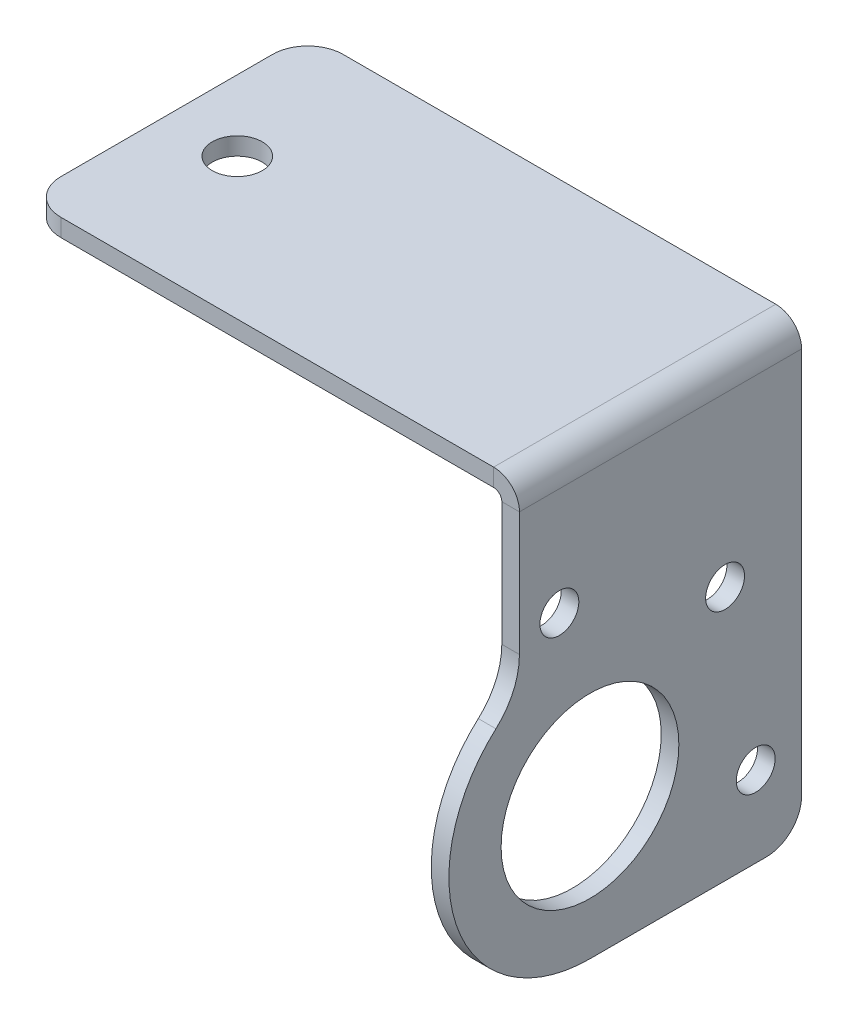
ISO-10303-21;
HEADER;
FILE_DESCRIPTION(('STEP AP214'),'2;1');
FILE_NAME('part.step','',(''),(''),'','','');
FILE_SCHEMA(('AUTOMOTIVE_DESIGN { 1 0 10303 214 1 1 1 1 }'));
ENDSEC;
DATA;
#1=APPLICATION_CONTEXT('core data for automotive mechanical design processes');
#2=APPLICATION_PROTOCOL_DEFINITION('international standard','automotive_design',2000,#1);
#3=PRODUCT_CONTEXT('',#1,'mechanical');
#4=PRODUCT('Part','Part','',(#3));
#5=PRODUCT_RELATED_PRODUCT_CATEGORY('part','',(#4));
#6=PRODUCT_DEFINITION_FORMATION('','',#4);
#7=PRODUCT_DEFINITION_CONTEXT('part definition',#1,'design');
#8=PRODUCT_DEFINITION('design','',#6,#7);
#9=PRODUCT_DEFINITION_SHAPE('','',#8);
#10=(LENGTH_UNIT() NAMED_UNIT(*) SI_UNIT(.MILLI.,.METRE.));
#11=(NAMED_UNIT(*) PLANE_ANGLE_UNIT() SI_UNIT($,.RADIAN.));
#12=(NAMED_UNIT(*) SI_UNIT($,.STERADIAN.) SOLID_ANGLE_UNIT());
#13=UNCERTAINTY_MEASURE_WITH_UNIT(LENGTH_MEASURE(1.E-05),#10,'distance_accuracy_value','');
#14=(GEOMETRIC_REPRESENTATION_CONTEXT(3) GLOBAL_UNCERTAINTY_ASSIGNED_CONTEXT((#13)) GLOBAL_UNIT_ASSIGNED_CONTEXT((#10,
#11,#12)) REPRESENTATION_CONTEXT('',''));
#15=CARTESIAN_POINT('',(0.,0.,0.));
#16=DIRECTION('',(0.,0.,1.));
#17=DIRECTION('',(1.,0.,0.));
#18=AXIS2_PLACEMENT_3D('',#15,#16,#17);
#19=CARTESIAN_POINT('',(38.1,-13.4453001841658,19.05));
#20=DIRECTION('',(-1.,0.,0.));
#21=DIRECTION('',(0.,0.,-1.));
#22=AXIS2_PLACEMENT_3D('',#19,#20,#21);
#23=PLANE('',#22);
#24=CARTESIAN_POINT('',(38.0999999999999,-27.6443318412894,6.35));
#25=DIRECTION('',(1.,0.,0.));
#26=DIRECTION('',(0.,0.,1.));
#27=AXIS2_PLACEMENT_3D('',#24,#25,#26);
#28=CIRCLE('',#27,8.);
#29=CARTESIAN_POINT('',(38.0999999999999,-27.6443318412894,14.35));
#30=VERTEX_POINT('',#29);
#31=EDGE_CURVE('E237',#30,#30,#28,.T.);
#32=ORIENTED_EDGE('',*,*,#31,.F.);
#33=EDGE_LOOP('',(#32));
#34=FACE_BOUND('',#33,.T.);
#35=CARTESIAN_POINT('',(38.1,-12.0105087622206,9.10666482046241));
#36=DIRECTION('',(1.,0.,0.));
#37=DIRECTION('',(0.,0.,1.));
#38=AXIS2_PLACEMENT_3D('',#35,#36,#37);
#39=CIRCLE('',#38,1.75);
#40=CARTESIAN_POINT('',(38.1,-12.0105087622206,10.8566648204624));
#41=VERTEX_POINT('',#40);
#42=EDGE_CURVE('E231',#41,#41,#39,.T.);
#43=ORIENTED_EDGE('',*,*,#42,.F.);
#44=EDGE_LOOP('',(#43));
#45=FACE_BOUND('',#44,.T.);
#46=CARTESIAN_POINT('',(38.0999999999999,-17.4400785375157,-5.81095553451387));
#47=DIRECTION('',(1.,0.,0.));
#48=DIRECTION('',(0.,0.,1.));
#49=AXIS2_PLACEMENT_3D('',#46,#47,#48);
#50=CIRCLE('',#49,1.75000000000001);
#51=CARTESIAN_POINT('',(38.0999999999999,-17.4400785375157,-4.06095553451386));
#52=VERTEX_POINT('',#51);
#53=EDGE_CURVE('E224',#52,#52,#50,.T.);
#54=ORIENTED_EDGE('',*,*,#53,.F.);
#55=EDGE_LOOP('',(#54));
#56=FACE_BOUND('',#55,.T.);
#57=CARTESIAN_POINT('',(38.0999999999999,-33.0739016165846,-8.56762035497623));
#58=DIRECTION('',(1.,0.,0.));
#59=DIRECTION('',(0.,0.,1.));
#60=AXIS2_PLACEMENT_3D('',#57,#58,#59);
#61=CIRCLE('',#60,1.75);
#62=CARTESIAN_POINT('',(38.0999999999999,-33.0739016165846,-6.81762035497623));
#63=VERTEX_POINT('',#62);
#64=EDGE_CURVE('E225',#63,#63,#61,.T.);
#65=ORIENTED_EDGE('',*,*,#64,.F.);
#66=EDGE_LOOP('',(#65));
#67=FACE_BOUND('',#66,.T.);
#68=DIRECTION('',(0.,1.,0.));
#69=VECTOR('',#68,1.);
#70=CARTESIAN_POINT('',(38.1000000000002,39.0306681587105,-12.7));
#71=LINE('',#70,#69);
#72=CARTESIAN_POINT('',(38.0999999999999,-37.1693318412894,-12.7));
#73=VERTEX_POINT('',#72);
#74=CARTESIAN_POINT('',(38.1,-2.32410000000001,-12.7));
#75=VERTEX_POINT('',#74);
#76=EDGE_CURVE('E64',#73,#75,#71,.T.);
#77=ORIENTED_EDGE('',*,*,#76,.T.);
#78=DIRECTION('',(0.,0.,1.));
#79=VECTOR('',#78,1.);
#80=CARTESIAN_POINT('',(38.1,-2.32410000000001,19.05));
#81=LINE('',#80,#79);
#82=CARTESIAN_POINT('',(38.1,-2.32410000000001,12.7));
#83=VERTEX_POINT('',#82);
#84=EDGE_CURVE('E56',#75,#83,#81,.T.);
#85=ORIENTED_EDGE('',*,*,#84,.T.);
#86=DIRECTION('',(0.,-1.,0.));
#87=VECTOR('',#86,1.);
#88=CARTESIAN_POINT('',(38.1000000000002,39.0306681587105,12.7));
#89=LINE('',#88,#87);
#90=CARTESIAN_POINT('',(38.1,-13.4453001841658,12.7));
#91=VERTEX_POINT('',#90);
#92=EDGE_CURVE('E72',#83,#91,#89,.T.);
#93=ORIENTED_EDGE('',*,*,#92,.T.);
#94=CARTESIAN_POINT('',(38.1,-13.4453001841658,19.05));
#95=DIRECTION('',(-1.,0.,0.));
#96=DIRECTION('',(0.,0.,-1.));
#97=AXIS2_PLACEMENT_3D('',#94,#95,#96);
#98=CIRCLE('',#97,6.35);
#99=CARTESIAN_POINT('',(38.0999999999999,-18.1783107365403,14.8166666666667));
#100=VERTEX_POINT('',#99);
#101=EDGE_CURVE('E243',#91,#100,#98,.T.);
#102=ORIENTED_EDGE('',*,*,#101,.T.);
#103=CARTESIAN_POINT('',(38.0999999999999,-27.6443318412894,6.35));
#104=DIRECTION('',(1.,0.,0.));
#105=DIRECTION('',(0.,0.,1.));
#106=AXIS2_PLACEMENT_3D('',#103,#104,#105);
#107=CIRCLE('',#106,12.7);
#108=CARTESIAN_POINT('',(38.0999999999999,-40.3443318412894,6.35));
#109=VERTEX_POINT('',#108);
#110=EDGE_CURVE('E261',#100,#109,#107,.T.);
#111=ORIENTED_EDGE('',*,*,#110,.T.);
#112=DIRECTION('',(0.,0.,-1.));
#113=VECTOR('',#112,1.);
#114=CARTESIAN_POINT('',(38.0999999999999,-40.3443318412894,6.35));
#115=LINE('',#114,#113);
#116=CARTESIAN_POINT('',(38.0999999999999,-40.3443318412894,-9.52499999999998));
#117=VERTEX_POINT('',#116);
#118=EDGE_CURVE('E264',#109,#117,#115,.T.);
#119=ORIENTED_EDGE('',*,*,#118,.T.);
#120=CARTESIAN_POINT('',(38.0999999999999,-37.1693318412894,-9.525));
#121=DIRECTION('',(1.,0.,0.));
#122=DIRECTION('',(0.,0.,-1.));
#123=AXIS2_PLACEMENT_3D('',#120,#121,#122);
#124=CIRCLE('',#123,3.175);
#125=EDGE_CURVE('E267',#117,#73,#124,.T.);
#126=ORIENTED_EDGE('',*,*,#125,.T.);
#127=EDGE_LOOP('',(#77,#85,#93,#102,#111,#119,#126));
#128=FACE_BOUND('',#127,.T.);
#129=ADVANCED_FACE('F47',(#34,#45,#56,#67,#128),#23,.F.);
#130=CARTESIAN_POINT('',(36.5125000000001,39.0306681587106,12.7));
#131=DIRECTION('',(0.,0.,1.));
#132=DIRECTION('',(0.,-1.,0.));
#133=AXIS2_PLACEMENT_3D('',#130,#131,#132);
#134=PLANE('',#133);
#135=DIRECTION('',(1.,0.,0.));
#136=VECTOR('',#135,1.);
#137=CARTESIAN_POINT('',(36.5125,-2.3241,12.7));
#138=LINE('',#137,#136);
#139=CARTESIAN_POINT('',(36.5125,-2.3241,12.7));
#140=VERTEX_POINT('',#139);
#141=EDGE_CURVE('E282',#140,#83,#138,.T.);
#142=ORIENTED_EDGE('',*,*,#141,.F.);
#143=DIRECTION('',(0.,-1.,0.));
#144=VECTOR('',#143,1.);
#145=CARTESIAN_POINT('',(36.5125,-2.24433184128942,12.7));
#146=LINE('',#145,#144);
#147=CARTESIAN_POINT('',(36.5125,-13.4453001841658,12.7));
#148=VERTEX_POINT('',#147);
#149=EDGE_CURVE('E51',#140,#148,#146,.T.);
#150=ORIENTED_EDGE('',*,*,#149,.T.);
#151=DIRECTION('',(1.,0.,0.));
#152=VECTOR('',#151,1.);
#153=CARTESIAN_POINT('',(36.5125,-13.4453001841658,12.7));
#154=LINE('',#153,#152);
#155=EDGE_CURVE('E279',#148,#91,#154,.T.);
#156=ORIENTED_EDGE('',*,*,#155,.T.);
#157=ORIENTED_EDGE('',*,*,#92,.F.);
#158=EDGE_LOOP('',(#142,#150,#156,#157));
#159=FACE_BOUND('',#158,.T.);
#160=ADVANCED_FACE('F290',(#159),#134,.T.);
#161=CARTESIAN_POINT('',(36.5125000000001,39.0306681587106,-12.7));
#162=DIRECTION('',(0.,0.,-1.));
#163=DIRECTION('',(0.,1.,0.));
#164=AXIS2_PLACEMENT_3D('',#161,#162,#163);
#165=PLANE('',#164);
#166=DIRECTION('',(-1.,0.,0.));
#167=VECTOR('',#166,1.);
#168=CARTESIAN_POINT('',(36.5125,-2.3241,-12.7));
#169=LINE('',#168,#167);
#170=CARTESIAN_POINT('',(36.5125,-2.3241,-12.7));
#171=VERTEX_POINT('',#170);
#172=EDGE_CURVE('E12',#75,#171,#169,.T.);
#173=ORIENTED_EDGE('',*,*,#172,.F.);
#174=ORIENTED_EDGE('',*,*,#76,.F.);
#175=DIRECTION('',(1.,0.,0.));
#176=VECTOR('',#175,1.);
#177=CARTESIAN_POINT('',(36.5124999999999,-37.1693318412894,-12.7));
#178=LINE('',#177,#176);
#179=CARTESIAN_POINT('',(36.5124999999999,-37.1693318412894,-12.7));
#180=VERTEX_POINT('',#179);
#181=EDGE_CURVE('E269',#180,#73,#178,.T.);
#182=ORIENTED_EDGE('',*,*,#181,.F.);
#183=DIRECTION('',(0.,1.,0.));
#184=VECTOR('',#183,1.);
#185=CARTESIAN_POINT('',(36.5125,-2.24433184128942,-12.7));
#186=LINE('',#185,#184);
#187=EDGE_CURVE('E258',#180,#171,#186,.T.);
#188=ORIENTED_EDGE('',*,*,#187,.T.);
#189=EDGE_LOOP('',(#173,#174,#182,#188));
#190=FACE_BOUND('',#189,.T.);
#191=ADVANCED_FACE('F49',(#190),#165,.T.);
#192=CARTESIAN_POINT('',(36.5124999999999,-37.1693318412894,-9.525));
#193=DIRECTION('',(1.,0.,0.));
#194=DIRECTION('',(0.,0.,1.));
#195=AXIS2_PLACEMENT_3D('',#192,#193,#194);
#196=CYLINDRICAL_SURFACE('',#195,3.175);
#197=ORIENTED_EDGE('',*,*,#125,.F.);
#198=DIRECTION('',(1.,0.,0.));
#199=VECTOR('',#198,1.);
#200=CARTESIAN_POINT('',(36.5124999999999,-40.3443318412894,-9.52499999999998));
#201=LINE('',#200,#199);
#202=CARTESIAN_POINT('',(36.5124999999999,-40.3443318412894,-9.52499999999998));
#203=VERTEX_POINT('',#202);
#204=EDGE_CURVE('E273',#203,#117,#201,.T.);
#205=ORIENTED_EDGE('',*,*,#204,.F.);
#206=CARTESIAN_POINT('',(36.5124999999999,-37.1693318412894,-9.525));
#207=DIRECTION('',(1.,0.,0.));
#208=DIRECTION('',(0.,0.,-1.));
#209=AXIS2_PLACEMENT_3D('',#206,#207,#208);
#210=CIRCLE('',#209,3.175);
#211=EDGE_CURVE('E255',#203,#180,#210,.T.);
#212=ORIENTED_EDGE('',*,*,#211,.T.);
#213=ORIENTED_EDGE('',*,*,#181,.T.);
#214=EDGE_LOOP('',(#197,#205,#212,#213));
#215=FACE_BOUND('',#214,.T.);
#216=ADVANCED_FACE('F324',(#215),#196,.T.);
#217=CARTESIAN_POINT('',(36.5124999999999,-40.3443318412894,6.35));
#218=DIRECTION('',(0.,-1.,0.));
#219=DIRECTION('',(0.,0.,-1.));
#220=AXIS2_PLACEMENT_3D('',#217,#218,#219);
#221=PLANE('',#220);
#222=ORIENTED_EDGE('',*,*,#118,.F.);
#223=DIRECTION('',(1.,0.,0.));
#224=VECTOR('',#223,1.);
#225=CARTESIAN_POINT('',(36.5124999999999,-40.3443318412894,6.35));
#226=LINE('',#225,#224);
#227=CARTESIAN_POINT('',(36.5124999999999,-40.3443318412894,6.35));
#228=VERTEX_POINT('',#227);
#229=EDGE_CURVE('E275',#228,#109,#226,.T.);
#230=ORIENTED_EDGE('',*,*,#229,.F.);
#231=DIRECTION('',(0.,0.,-1.));
#232=VECTOR('',#231,1.);
#233=CARTESIAN_POINT('',(36.5124999999999,-40.3443318412894,6.35));
#234=LINE('',#233,#232);
#235=EDGE_CURVE('E252',#228,#203,#234,.T.);
#236=ORIENTED_EDGE('',*,*,#235,.T.);
#237=ORIENTED_EDGE('',*,*,#204,.T.);
#238=EDGE_LOOP('',(#222,#230,#236,#237));
#239=FACE_BOUND('',#238,.T.);
#240=ADVANCED_FACE('F321',(#239),#221,.T.);
#241=CARTESIAN_POINT('',(36.5124999999999,-27.6443318412894,6.35));
#242=DIRECTION('',(1.,0.,0.));
#243=DIRECTION('',(0.,0.,1.));
#244=AXIS2_PLACEMENT_3D('',#241,#242,#243);
#245=CYLINDRICAL_SURFACE('',#244,12.7);
#246=ORIENTED_EDGE('',*,*,#110,.F.);
#247=DIRECTION('',(1.,0.,0.));
#248=VECTOR('',#247,1.);
#249=CARTESIAN_POINT('',(36.5124999999999,-18.1783107365403,14.8166666666667));
#250=LINE('',#249,#248);
#251=CARTESIAN_POINT('',(36.5124999999999,-18.1783107365403,14.8166666666667));
#252=VERTEX_POINT('',#251);
#253=EDGE_CURVE('E277',#252,#100,#250,.T.);
#254=ORIENTED_EDGE('',*,*,#253,.F.);
#255=CARTESIAN_POINT('',(36.5124999999999,-27.6443318412894,6.35));
#256=DIRECTION('',(1.,0.,0.));
#257=DIRECTION('',(0.,0.,1.));
#258=AXIS2_PLACEMENT_3D('',#255,#256,#257);
#259=CIRCLE('',#258,12.7);
#260=EDGE_CURVE('E249',#252,#228,#259,.T.);
#261=ORIENTED_EDGE('',*,*,#260,.T.);
#262=ORIENTED_EDGE('',*,*,#229,.T.);
#263=EDGE_LOOP('',(#246,#254,#261,#262));
#264=FACE_BOUND('',#263,.T.);
#265=ADVANCED_FACE('F303',(#264),#245,.T.);
#266=CARTESIAN_POINT('',(36.5125,-13.4453001841658,19.05));
#267=DIRECTION('',(1.,0.,0.));
#268=DIRECTION('',(0.,0.,1.));
#269=AXIS2_PLACEMENT_3D('',#266,#267,#268);
#270=CYLINDRICAL_SURFACE('',#269,6.35);
#271=ORIENTED_EDGE('',*,*,#101,.F.);
#272=ORIENTED_EDGE('',*,*,#155,.F.);
#273=CARTESIAN_POINT('',(36.5125,-13.4453001841658,19.05));
#274=DIRECTION('',(-1.,0.,0.));
#275=DIRECTION('',(0.,0.,-1.));
#276=AXIS2_PLACEMENT_3D('',#273,#274,#275);
#277=CIRCLE('',#276,6.35);
#278=EDGE_CURVE('E246',#148,#252,#277,.T.);
#279=ORIENTED_EDGE('',*,*,#278,.T.);
#280=ORIENTED_EDGE('',*,*,#253,.T.);
#281=EDGE_LOOP('',(#271,#272,#279,#280));
#282=FACE_BOUND('',#281,.T.);
#283=ADVANCED_FACE('F295',(#282),#270,.F.);
#284=CARTESIAN_POINT('',(36.5125,-13.4453001841658,19.05));
#285=DIRECTION('',(-1.,0.,0.));
#286=DIRECTION('',(0.,0.,-1.));
#287=AXIS2_PLACEMENT_3D('',#284,#285,#286);
#288=PLANE('',#287);
#289=DIRECTION('',(0.,0.,1.));
#290=VECTOR('',#289,1.);
#291=CARTESIAN_POINT('',(36.5125,-2.3241,19.05));
#292=LINE('',#291,#290);
#293=EDGE_CURVE('E272',#171,#140,#292,.T.);
#294=ORIENTED_EDGE('',*,*,#293,.F.);
#295=ORIENTED_EDGE('',*,*,#187,.F.);
#296=ORIENTED_EDGE('',*,*,#211,.F.);
#297=ORIENTED_EDGE('',*,*,#235,.F.);
#298=ORIENTED_EDGE('',*,*,#260,.F.);
#299=ORIENTED_EDGE('',*,*,#278,.F.);
#300=ORIENTED_EDGE('',*,*,#149,.F.);
#301=EDGE_LOOP('',(#294,#295,#296,#297,#298,#299,#300));
#302=FACE_BOUND('',#301,.T.);
#303=CARTESIAN_POINT('',(36.5124999999999,-33.0739016165846,-8.56762035497623));
#304=DIRECTION('',(1.,0.,0.));
#305=DIRECTION('',(0.,0.,1.));
#306=AXIS2_PLACEMENT_3D('',#303,#304,#305);
#307=CIRCLE('',#306,1.75);
#308=CARTESIAN_POINT('',(36.5124999999999,-33.0739016165846,-6.81762035497623));
#309=VERTEX_POINT('',#308);
#310=EDGE_CURVE('E221',#309,#309,#307,.T.);
#311=ORIENTED_EDGE('',*,*,#310,.T.);
#312=EDGE_LOOP('',(#311));
#313=FACE_BOUND('',#312,.T.);
#314=CARTESIAN_POINT('',(36.5124999999999,-17.4400785375157,-5.81095553451387));
#315=DIRECTION('',(1.,0.,0.));
#316=DIRECTION('',(0.,0.,1.));
#317=AXIS2_PLACEMENT_3D('',#314,#315,#316);
#318=CIRCLE('',#317,1.75000000000001);
#319=CARTESIAN_POINT('',(36.5124999999999,-17.4400785375157,-4.06095553451386));
#320=VERTEX_POINT('',#319);
#321=EDGE_CURVE('E228',#320,#320,#318,.T.);
#322=ORIENTED_EDGE('',*,*,#321,.T.);
#323=EDGE_LOOP('',(#322));
#324=FACE_BOUND('',#323,.T.);
#325=CARTESIAN_POINT('',(36.5125,-12.0105087622206,9.10666482046241));
#326=DIRECTION('',(1.,0.,0.));
#327=DIRECTION('',(0.,0.,1.));
#328=AXIS2_PLACEMENT_3D('',#325,#326,#327);
#329=CIRCLE('',#328,1.75);
#330=CARTESIAN_POINT('',(36.5125,-12.0105087622206,10.8566648204624));
#331=VERTEX_POINT('',#330);
#332=EDGE_CURVE('E234',#331,#331,#329,.T.);
#333=ORIENTED_EDGE('',*,*,#332,.T.);
#334=EDGE_LOOP('',(#333));
#335=FACE_BOUND('',#334,.T.);
#336=CARTESIAN_POINT('',(36.5124999999999,-27.6443318412894,6.35));
#337=DIRECTION('',(1.,0.,0.));
#338=DIRECTION('',(0.,0.,1.));
#339=AXIS2_PLACEMENT_3D('',#336,#337,#338);
#340=CIRCLE('',#339,8.);
#341=CARTESIAN_POINT('',(36.5124999999999,-27.6443318412894,14.35));
#342=VERTEX_POINT('',#341);
#343=EDGE_CURVE('E240',#342,#342,#340,.T.);
#344=ORIENTED_EDGE('',*,*,#343,.T.);
#345=EDGE_LOOP('',(#344));
#346=FACE_BOUND('',#345,.T.);
#347=ADVANCED_FACE('F297',(#302,#313,#324,#335,#346),#288,.T.);
#348=CARTESIAN_POINT('',(36.5124999999999,-27.6443318412894,6.35));
#349=DIRECTION('',(1.,0.,0.));
#350=DIRECTION('',(0.,0.,1.));
#351=AXIS2_PLACEMENT_3D('',#348,#349,#350);
#352=CYLINDRICAL_SURFACE('',#351,8.);
#353=ORIENTED_EDGE('',*,*,#343,.F.);
#354=EDGE_LOOP('',(#353));
#355=FACE_BOUND('',#354,.T.);
#356=ORIENTED_EDGE('',*,*,#31,.T.);
#357=EDGE_LOOP('',(#356));
#358=FACE_BOUND('',#357,.T.);
#359=ADVANCED_FACE('F316',(#355,#358),#352,.F.);
#360=CARTESIAN_POINT('',(36.5125,-12.0105087622206,9.10666482046241));
#361=DIRECTION('',(1.,0.,0.));
#362=DIRECTION('',(0.,0.,1.));
#363=AXIS2_PLACEMENT_3D('',#360,#361,#362);
#364=CYLINDRICAL_SURFACE('',#363,1.75);
#365=ORIENTED_EDGE('',*,*,#332,.F.);
#366=EDGE_LOOP('',(#365));
#367=FACE_BOUND('',#366,.T.);
#368=ORIENTED_EDGE('',*,*,#42,.T.);
#369=EDGE_LOOP('',(#368));
#370=FACE_BOUND('',#369,.T.);
#371=ADVANCED_FACE('F331',(#367,#370),#364,.F.);
#372=CARTESIAN_POINT('',(36.5124999999999,-17.4400785375157,-5.81095553451387));
#373=DIRECTION('',(1.,0.,0.));
#374=DIRECTION('',(0.,0.,1.));
#375=AXIS2_PLACEMENT_3D('',#372,#373,#374);
#376=CYLINDRICAL_SURFACE('',#375,1.75000000000001);
#377=ORIENTED_EDGE('',*,*,#321,.F.);
#378=EDGE_LOOP('',(#377));
#379=FACE_BOUND('',#378,.T.);
#380=ORIENTED_EDGE('',*,*,#53,.T.);
#381=EDGE_LOOP('',(#380));
#382=FACE_BOUND('',#381,.T.);
#383=ADVANCED_FACE('F335',(#379,#382),#376,.F.);
#384=CARTESIAN_POINT('',(36.5124999999999,-33.0739016165846,-8.56762035497623));
#385=DIRECTION('',(1.,0.,0.));
#386=DIRECTION('',(0.,0.,1.));
#387=AXIS2_PLACEMENT_3D('',#384,#385,#386);
#388=CYLINDRICAL_SURFACE('',#387,1.75);
#389=ORIENTED_EDGE('',*,*,#310,.F.);
#390=EDGE_LOOP('',(#389));
#391=FACE_BOUND('',#390,.T.);
#392=ORIENTED_EDGE('',*,*,#64,.T.);
#393=EDGE_LOOP('',(#392));
#394=FACE_BOUND('',#393,.T.);
#395=ADVANCED_FACE('F339',(#391,#394),#388,.F.);
#396=CARTESIAN_POINT('',(-3.175,-1.5875,-9.525));
#397=DIRECTION('',(0.,1.,0.));
#398=DIRECTION('',(0.,0.,1.));
#399=AXIS2_PLACEMENT_3D('',#396,#397,#398);
#400=CYLINDRICAL_SURFACE('',#399,3.175);
#401=CARTESIAN_POINT('',(-3.175,0.,-9.525));
#402=DIRECTION('',(0.,1.,0.));
#403=DIRECTION('',(0.,0.,1.));
#404=AXIS2_PLACEMENT_3D('',#401,#402,#403);
#405=CIRCLE('',#404,3.175);
#406=CARTESIAN_POINT('',(-3.17499999999998,0.,-12.7));
#407=VERTEX_POINT('',#406);
#408=CARTESIAN_POINT('',(-6.35,0.,-9.52499999999998));
#409=VERTEX_POINT('',#408);
#410=EDGE_CURVE('E193',#407,#409,#405,.T.);
#411=ORIENTED_EDGE('',*,*,#410,.F.);
#412=DIRECTION('',(0.,1.,0.));
#413=VECTOR('',#412,1.);
#414=CARTESIAN_POINT('',(-3.17499999999998,-1.5875,-12.7));
#415=LINE('',#414,#413);
#416=CARTESIAN_POINT('',(-3.17499999999998,-1.5875,-12.7));
#417=VERTEX_POINT('',#416);
#418=EDGE_CURVE('E175',#417,#407,#415,.T.);
#419=ORIENTED_EDGE('',*,*,#418,.F.);
#420=CARTESIAN_POINT('',(-3.175,-1.5875,-9.525));
#421=DIRECTION('',(0.,1.,0.));
#422=DIRECTION('',(0.,0.,1.));
#423=AXIS2_PLACEMENT_3D('',#420,#421,#422);
#424=CIRCLE('',#423,3.175);
#425=CARTESIAN_POINT('',(-6.35,-1.5875,-9.52499999999998));
#426=VERTEX_POINT('',#425);
#427=EDGE_CURVE('E171',#417,#426,#424,.T.);
#428=ORIENTED_EDGE('',*,*,#427,.T.);
#429=DIRECTION('',(0.,1.,0.));
#430=VECTOR('',#429,1.);
#431=CARTESIAN_POINT('',(-6.35,-1.5875,-9.52499999999998));
#432=LINE('',#431,#430);
#433=EDGE_CURVE('E216',#426,#409,#432,.T.);
#434=ORIENTED_EDGE('',*,*,#433,.T.);
#435=EDGE_LOOP('',(#411,#419,#428,#434));
#436=FACE_BOUND('',#435,.T.);
#437=ADVANCED_FACE('F343',(#436),#400,.T.);
#438=CARTESIAN_POINT('',(-6.35,-1.5875,-9.52499999999998));
#439=DIRECTION('',(-1.,0.,0.));
#440=DIRECTION('',(0.,0.,1.));
#441=AXIS2_PLACEMENT_3D('',#438,#439,#440);
#442=PLANE('',#441);
#443=DIRECTION('',(0.,0.,1.));
#444=VECTOR('',#443,1.);
#445=CARTESIAN_POINT('',(-6.35,0.,-9.52499999999998));
#446=LINE('',#445,#444);
#447=CARTESIAN_POINT('',(-6.35,0.,9.52499999999998));
#448=VERTEX_POINT('',#447);
#449=EDGE_CURVE('E190',#409,#448,#446,.T.);
#450=ORIENTED_EDGE('',*,*,#449,.F.);
#451=ORIENTED_EDGE('',*,*,#433,.F.);
#452=DIRECTION('',(0.,0.,1.));
#453=VECTOR('',#452,1.);
#454=CARTESIAN_POINT('',(-6.35,-1.5875,-9.52499999999998));
#455=LINE('',#454,#453);
#456=CARTESIAN_POINT('',(-6.35,-1.5875,9.52499999999998));
#457=VERTEX_POINT('',#456);
#458=EDGE_CURVE('E213',#426,#457,#455,.T.);
#459=ORIENTED_EDGE('',*,*,#458,.T.);
#460=DIRECTION('',(0.,1.,0.));
#461=VECTOR('',#460,1.);
#462=CARTESIAN_POINT('',(-6.35,-1.5875,9.52499999999998));
#463=LINE('',#462,#461);
#464=EDGE_CURVE('E211',#457,#448,#463,.T.);
#465=ORIENTED_EDGE('',*,*,#464,.T.);
#466=EDGE_LOOP('',(#450,#451,#459,#465));
#467=FACE_BOUND('',#466,.T.);
#468=ADVANCED_FACE('F365',(#467),#442,.T.);
#469=CARTESIAN_POINT('',(-3.175,-1.5875,9.525));
#470=DIRECTION('',(0.,1.,0.));
#471=DIRECTION('',(0.,0.,1.));
#472=AXIS2_PLACEMENT_3D('',#469,#470,#471);
#473=CYLINDRICAL_SURFACE('',#472,3.175);
#474=CARTESIAN_POINT('',(-3.175,0.,9.525));
#475=DIRECTION('',(0.,1.,0.));
#476=DIRECTION('',(0.,0.,1.));
#477=AXIS2_PLACEMENT_3D('',#474,#475,#476);
#478=CIRCLE('',#477,3.175);
#479=CARTESIAN_POINT('',(-3.17499999999998,0.,12.7));
#480=VERTEX_POINT('',#479);
#481=EDGE_CURVE('E184',#448,#480,#478,.T.);
#482=ORIENTED_EDGE('',*,*,#481,.F.);
#483=ORIENTED_EDGE('',*,*,#464,.F.);
#484=CARTESIAN_POINT('',(-3.175,-1.5875,9.525));
#485=DIRECTION('',(0.,1.,0.));
#486=DIRECTION('',(0.,0.,1.));
#487=AXIS2_PLACEMENT_3D('',#484,#485,#486);
#488=CIRCLE('',#487,3.175);
#489=CARTESIAN_POINT('',(-3.17499999999998,-1.5875,12.7));
#490=VERTEX_POINT('',#489);
#491=EDGE_CURVE('E208',#457,#490,#488,.T.);
#492=ORIENTED_EDGE('',*,*,#491,.T.);
#493=DIRECTION('',(0.,1.,0.));
#494=VECTOR('',#493,1.);
#495=CARTESIAN_POINT('',(-3.17499999999998,-1.5875,12.7));
#496=LINE('',#495,#494);
#497=EDGE_CURVE('E206',#490,#480,#496,.T.);
#498=ORIENTED_EDGE('',*,*,#497,.T.);
#499=EDGE_LOOP('',(#482,#483,#492,#498));
#500=FACE_BOUND('',#499,.T.);
#501=ADVANCED_FACE('F361',(#500),#473,.T.);
#502=CARTESIAN_POINT('',(0.,-1.5875,0.));
#503=DIRECTION('',(0.,1.,0.));
#504=DIRECTION('',(0.,0.,1.));
#505=AXIS2_PLACEMENT_3D('',#502,#503,#504);
#506=CYLINDRICAL_SURFACE('',#505,2.25);
#507=CARTESIAN_POINT('',(0.,-1.5875,0.));
#508=DIRECTION('',(0.,1.,0.));
#509=DIRECTION('',(0.,0.,1.));
#510=AXIS2_PLACEMENT_3D('',#507,#508,#509);
#511=CIRCLE('',#510,2.25);
#512=CARTESIAN_POINT('',(0.,-1.5875,2.25));
#513=VERTEX_POINT('',#512);
#514=EDGE_CURVE('E164',#513,#513,#511,.T.);
#515=ORIENTED_EDGE('',*,*,#514,.F.);
#516=EDGE_LOOP('',(#515));
#517=FACE_BOUND('',#516,.T.);
#518=CARTESIAN_POINT('',(0.,0.,0.));
#519=DIRECTION('',(0.,1.,0.));
#520=DIRECTION('',(0.,0.,1.));
#521=AXIS2_PLACEMENT_3D('',#518,#519,#520);
#522=CIRCLE('',#521,2.25);
#523=CARTESIAN_POINT('',(0.,0.,2.25));
#524=VERTEX_POINT('',#523);
#525=EDGE_CURVE('E203',#524,#524,#522,.T.);
#526=ORIENTED_EDGE('',*,*,#525,.T.);
#527=EDGE_LOOP('',(#526));
#528=FACE_BOUND('',#527,.T.);
#529=ADVANCED_FACE('F357',(#517,#528),#506,.F.);
#530=CARTESIAN_POINT('',(49.3009683428763,-1.5875,19.05));
#531=DIRECTION('',(0.,-1.,0.));
#532=DIRECTION('',(0.,0.,-1.));
#533=AXIS2_PLACEMENT_3D('',#530,#531,#532);
#534=PLANE('',#533);
#535=ORIENTED_EDGE('',*,*,#514,.T.);
#536=EDGE_LOOP('',(#535));
#537=FACE_BOUND('',#536,.T.);
#538=DIRECTION('',(-1.,0.,0.));
#539=VECTOR('',#538,1.);
#540=CARTESIAN_POINT('',(38.1,-1.5875,-12.7));
#541=LINE('',#540,#539);
#542=CARTESIAN_POINT('',(35.7759,-1.5875,-12.7));
#543=VERTEX_POINT('',#542);
#544=EDGE_CURVE('E167',#543,#417,#541,.T.);
#545=ORIENTED_EDGE('',*,*,#544,.F.);
#546=DIRECTION('',(0.,0.,1.));
#547=VECTOR('',#546,1.);
#548=CARTESIAN_POINT('',(35.7759,-1.5875,19.05));
#549=LINE('',#548,#547);
#550=CARTESIAN_POINT('',(35.7759,-1.5875,12.7));
#551=VERTEX_POINT('',#550);
#552=EDGE_CURVE('E157',#543,#551,#549,.T.);
#553=ORIENTED_EDGE('',*,*,#552,.T.);
#554=DIRECTION('',(1.,0.,0.));
#555=VECTOR('',#554,1.);
#556=CARTESIAN_POINT('',(38.1,-1.5875,12.7));
#557=LINE('',#556,#555);
#558=EDGE_CURVE('E163',#490,#551,#557,.T.);
#559=ORIENTED_EDGE('',*,*,#558,.F.);
#560=ORIENTED_EDGE('',*,*,#491,.F.);
#561=ORIENTED_EDGE('',*,*,#458,.F.);
#562=ORIENTED_EDGE('',*,*,#427,.F.);
#563=EDGE_LOOP('',(#545,#553,#559,#560,#561,#562));
#564=FACE_BOUND('',#563,.T.);
#565=ADVANCED_FACE('F168',(#537,#564),#534,.T.);
#566=CARTESIAN_POINT('',(-3.17499999999998,-1.5875,12.7));
#567=DIRECTION('',(0.,0.,1.));
#568=DIRECTION('',(1.,0.,0.));
#569=AXIS2_PLACEMENT_3D('',#566,#567,#568);
#570=PLANE('',#569);
#571=ORIENTED_EDGE('',*,*,#558,.T.);
#572=DIRECTION('',(0.,1.,0.));
#573=VECTOR('',#572,1.);
#574=CARTESIAN_POINT('',(35.7759,-1.5875,12.7));
#575=LINE('',#574,#573);
#576=CARTESIAN_POINT('',(35.7759,0.,12.7));
#577=VERTEX_POINT('',#576);
#578=EDGE_CURVE('E197',#551,#577,#575,.T.);
#579=ORIENTED_EDGE('',*,*,#578,.T.);
#580=DIRECTION('',(1.,0.,0.));
#581=VECTOR('',#580,1.);
#582=CARTESIAN_POINT('',(-3.17499999999998,0.,12.7));
#583=LINE('',#582,#581);
#584=EDGE_CURVE('E181',#480,#577,#583,.T.);
#585=ORIENTED_EDGE('',*,*,#584,.F.);
#586=ORIENTED_EDGE('',*,*,#497,.F.);
#587=EDGE_LOOP('',(#571,#579,#585,#586));
#588=FACE_BOUND('',#587,.T.);
#589=ADVANCED_FACE('F350',(#588),#570,.T.);
#590=CARTESIAN_POINT('',(49.3009683428763,0.,19.05));
#591=DIRECTION('',(0.,-1.,0.));
#592=DIRECTION('',(0.,0.,-1.));
#593=AXIS2_PLACEMENT_3D('',#590,#591,#592);
#594=PLANE('',#593);
#595=DIRECTION('',(0.,0.,1.));
#596=VECTOR('',#595,1.);
#597=CARTESIAN_POINT('',(35.7759,0.,19.05));
#598=LINE('',#597,#596);
#599=CARTESIAN_POINT('',(35.7759,0.,-12.7));
#600=VERTEX_POINT('',#599);
#601=EDGE_CURVE('E219',#600,#577,#598,.T.);
#602=ORIENTED_EDGE('',*,*,#601,.F.);
#603=DIRECTION('',(-1.,0.,0.));
#604=VECTOR('',#603,1.);
#605=CARTESIAN_POINT('',(-3.17499999999998,0.,-12.7));
#606=LINE('',#605,#604);
#607=EDGE_CURVE('E179',#600,#407,#606,.T.);
#608=ORIENTED_EDGE('',*,*,#607,.T.);
#609=ORIENTED_EDGE('',*,*,#410,.T.);
#610=ORIENTED_EDGE('',*,*,#449,.T.);
#611=ORIENTED_EDGE('',*,*,#481,.T.);
#612=ORIENTED_EDGE('',*,*,#584,.T.);
#613=EDGE_LOOP('',(#602,#608,#609,#610,#611,#612));
#614=FACE_BOUND('',#613,.T.);
#615=ORIENTED_EDGE('',*,*,#525,.F.);
#616=EDGE_LOOP('',(#615));
#617=FACE_BOUND('',#616,.T.);
#618=ADVANCED_FACE('F347',(#614,#617),#594,.F.);
#619=CARTESIAN_POINT('',(-3.17499999999998,-1.5875,-12.7));
#620=DIRECTION('',(0.,0.,-1.));
#621=DIRECTION('',(-1.,0.,0.));
#622=AXIS2_PLACEMENT_3D('',#619,#620,#621);
#623=PLANE('',#622);
#624=ORIENTED_EDGE('',*,*,#607,.F.);
#625=DIRECTION('',(0.,-1.,0.));
#626=VECTOR('',#625,1.);
#627=CARTESIAN_POINT('',(35.7759,-1.5875,-12.7));
#628=LINE('',#627,#626);
#629=EDGE_CURVE('E148',#600,#543,#628,.T.);
#630=ORIENTED_EDGE('',*,*,#629,.T.);
#631=ORIENTED_EDGE('',*,*,#544,.T.);
#632=ORIENTED_EDGE('',*,*,#418,.T.);
#633=EDGE_LOOP('',(#624,#630,#631,#632));
#634=FACE_BOUND('',#633,.T.);
#635=ADVANCED_FACE('F178',(#634),#623,.T.);
#636=CARTESIAN_POINT('',(35.7759,-2.3241,-12.7));
#637=DIRECTION('',(0.,0.,1.));
#638=DIRECTION('',(1.,0.,0.));
#639=AXIS2_PLACEMENT_3D('',#636,#637,#638);
#640=PLANE('',#639);
#641=ORIENTED_EDGE('',*,*,#629,.F.);
#642=CARTESIAN_POINT('',(35.7759,-2.3241,-12.7));
#643=DIRECTION('',(0.,0.,1.));
#644=DIRECTION('',(1.,0.,0.));
#645=AXIS2_PLACEMENT_3D('',#642,#643,#644);
#646=CIRCLE('',#645,2.3241);
#647=EDGE_CURVE('E587',#600,#75,#646,.F.);
#648=ORIENTED_EDGE('',*,*,#647,.T.);
#649=ORIENTED_EDGE('',*,*,#172,.T.);
#650=CARTESIAN_POINT('',(35.7759,-2.3241,-12.7));
#651=DIRECTION('',(0.,0.,-1.));
#652=DIRECTION('',(1.,0.,0.));
#653=AXIS2_PLACEMENT_3D('',#650,#651,#652);
#654=CIRCLE('',#653,0.736599999999998);
#655=EDGE_CURVE('E143',#543,#171,#654,.T.);
#656=ORIENTED_EDGE('',*,*,#655,.F.);
#657=EDGE_LOOP('',(#641,#648,#649,#656));
#658=FACE_BOUND('',#657,.T.);
#659=ADVANCED_FACE('F145',(#658),#640,.F.);
#660=CARTESIAN_POINT('',(35.7759,-2.3241,12.7));
#661=DIRECTION('',(0.,0.,-1.));
#662=DIRECTION('',(-1.,0.,0.));
#663=AXIS2_PLACEMENT_3D('',#660,#661,#662);
#664=PLANE('',#663);
#665=ORIENTED_EDGE('',*,*,#141,.T.);
#666=CARTESIAN_POINT('',(35.7759,-2.3241,12.7));
#667=DIRECTION('',(0.,0.,1.));
#668=DIRECTION('',(1.,0.,0.));
#669=AXIS2_PLACEMENT_3D('',#666,#667,#668);
#670=CIRCLE('',#669,2.3241);
#671=EDGE_CURVE('E153',#83,#577,#670,.T.);
#672=ORIENTED_EDGE('',*,*,#671,.T.);
#673=ORIENTED_EDGE('',*,*,#578,.F.);
#674=CARTESIAN_POINT('',(35.7759,-2.3241,12.7));
#675=DIRECTION('',(0.,0.,1.));
#676=DIRECTION('',(-1.,0.,0.));
#677=AXIS2_PLACEMENT_3D('',#674,#675,#676);
#678=CIRCLE('',#677,0.736599999999998);
#679=EDGE_CURVE('E152',#140,#551,#678,.T.);
#680=ORIENTED_EDGE('',*,*,#679,.F.);
#681=EDGE_LOOP('',(#665,#672,#673,#680));
#682=FACE_BOUND('',#681,.T.);
#683=ADVANCED_FACE('F375',(#682),#664,.F.);
#684=CARTESIAN_POINT('',(35.7759,-2.3241,-25.5628390124114));
#685=DIRECTION('',(0.,0.,1.));
#686=DIRECTION('',(1.,0.,0.));
#687=AXIS2_PLACEMENT_3D('',#684,#685,#686);
#688=CYLINDRICAL_SURFACE('',#687,0.7366);
#689=ORIENTED_EDGE('',*,*,#679,.T.);
#690=ORIENTED_EDGE('',*,*,#552,.F.);
#691=ORIENTED_EDGE('',*,*,#655,.T.);
#692=ORIENTED_EDGE('',*,*,#293,.T.);
#693=EDGE_LOOP('',(#689,#690,#691,#692));
#694=FACE_BOUND('',#693,.T.);
#695=ADVANCED_FACE('F159',(#694),#688,.F.);
#696=CARTESIAN_POINT('',(35.7759,-2.3241,-25.5628390124114));
#697=DIRECTION('',(0.,0.,1.));
#698=DIRECTION('',(1.,0.,0.));
#699=AXIS2_PLACEMENT_3D('',#696,#697,#698);
#700=CYLINDRICAL_SURFACE('',#699,2.3241);
#701=ORIENTED_EDGE('',*,*,#671,.F.);
#702=ORIENTED_EDGE('',*,*,#84,.F.);
#703=ORIENTED_EDGE('',*,*,#647,.F.);
#704=ORIENTED_EDGE('',*,*,#601,.T.);
#705=EDGE_LOOP('',(#701,#702,#703,#704));
#706=FACE_BOUND('',#705,.T.);
#707=ADVANCED_FACE('F379',(#706),#700,.T.);
#708=CLOSED_SHELL('',(#129,#160,#191,#216,#240,#265,#283,#347,#359,#371,#383,#395,#437,#468,
#501,#529,#565,#589,#618,#635,#659,#683,#695,#707));
#709=MANIFOLD_SOLID_BREP('B2',#708);
#710=ADVANCED_BREP_SHAPE_REPRESENTATION('',(#18,#709),#14);
#711=SHAPE_DEFINITION_REPRESENTATION(#9,#710);
ENDSEC;
END-ISO-10303-21;
